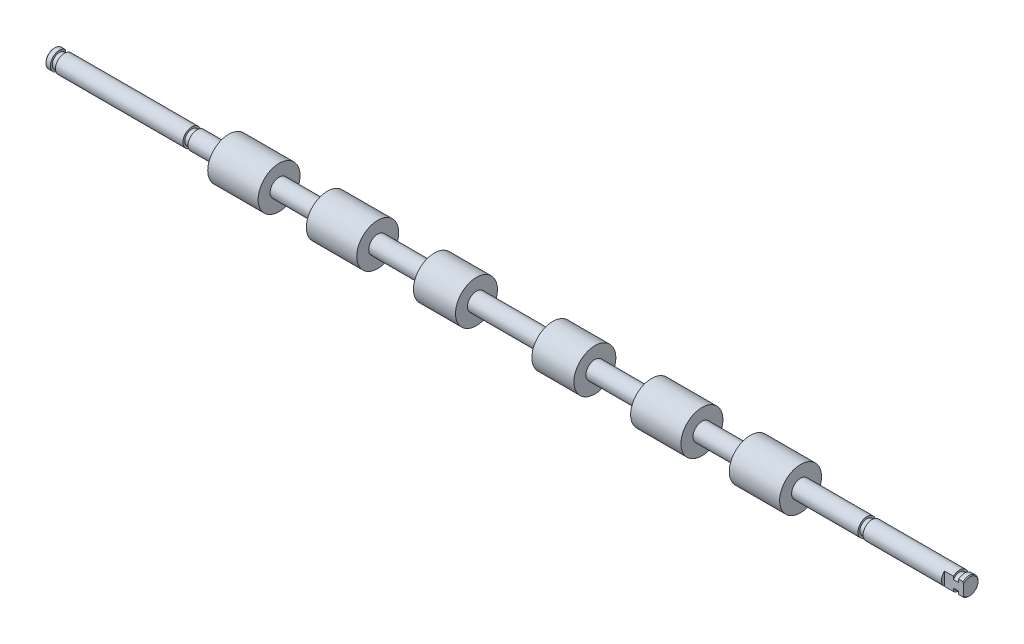
ISO-10303-21;
HEADER;
FILE_DESCRIPTION(('STEP AP214'),'2;1');
FILE_NAME('part.step','',(''),(''),'','','');
FILE_SCHEMA(('AUTOMOTIVE_DESIGN { 1 0 10303 214 1 1 1 1 }'));
ENDSEC;
DATA;
#1=APPLICATION_CONTEXT('core data for automotive mechanical design processes');
#2=APPLICATION_PROTOCOL_DEFINITION('international standard','automotive_design',2000,#1);
#3=PRODUCT_CONTEXT('',#1,'mechanical');
#4=PRODUCT('Part','Part','',(#3));
#5=PRODUCT_RELATED_PRODUCT_CATEGORY('part','',(#4));
#6=PRODUCT_DEFINITION_FORMATION('','',#4);
#7=PRODUCT_DEFINITION_CONTEXT('part definition',#1,'design');
#8=PRODUCT_DEFINITION('design','',#6,#7);
#9=PRODUCT_DEFINITION_SHAPE('','',#8);
#10=(LENGTH_UNIT() NAMED_UNIT(*) SI_UNIT(.MILLI.,.METRE.));
#11=(NAMED_UNIT(*) PLANE_ANGLE_UNIT() SI_UNIT($,.RADIAN.));
#12=(NAMED_UNIT(*) SI_UNIT($,.STERADIAN.) SOLID_ANGLE_UNIT());
#13=UNCERTAINTY_MEASURE_WITH_UNIT(LENGTH_MEASURE(1.E-05),#10,'distance_accuracy_value','');
#14=(GEOMETRIC_REPRESENTATION_CONTEXT(3) GLOBAL_UNCERTAINTY_ASSIGNED_CONTEXT((#13)) GLOBAL_UNIT_ASSIGNED_CONTEXT((#10,
#11,#12)) REPRESENTATION_CONTEXT('',''));
#15=CARTESIAN_POINT('',(0.,0.,0.));
#16=DIRECTION('',(0.,0.,1.));
#17=DIRECTION('',(1.,0.,0.));
#18=AXIS2_PLACEMENT_3D('',#15,#16,#17);
#19=CARTESIAN_POINT('',(0.,0.,0.));
#20=DIRECTION('',(1.,0.,0.));
#21=DIRECTION('',(0.,0.,-1.));
#22=AXIS2_PLACEMENT_3D('',#19,#20,#21);
#23=PLANE('',#22);
#24=DIRECTION('',(0.,1.,0.));
#25=VECTOR('',#24,1.);
#26=CARTESIAN_POINT('',(0.,-6.95,-2.005));
#27=LINE('',#26,#25);
#28=CARTESIAN_POINT('',(0.,-1.84542677990765,-2.005));
#29=VERTEX_POINT('',#28);
#30=CARTESIAN_POINT('',(0.,1.84542677990765,-2.005));
#31=VERTEX_POINT('',#30);
#32=EDGE_CURVE('E151',#29,#31,#27,.T.);
#33=ORIENTED_EDGE('',*,*,#32,.F.);
#34=CARTESIAN_POINT('',(0.,0.,0.));
#35=DIRECTION('',(1.,0.,0.));
#36=DIRECTION('',(0.,0.,-1.));
#37=AXIS2_PLACEMENT_3D('',#34,#35,#36);
#38=CIRCLE('',#37,2.72500000000006);
#39=EDGE_CURVE('E308',#29,#31,#38,.F.);
#40=ORIENTED_EDGE('',*,*,#39,.T.);
#41=EDGE_LOOP('',(#33,#40));
#42=FACE_BOUND('',#41,.T.);
#43=ADVANCED_FACE('F37',(#42),#23,.F.);
#44=CARTESIAN_POINT('',(0.,0.,0.));
#45=DIRECTION('',(-1.,0.,0.));
#46=DIRECTION('',(0.,0.,1.));
#47=AXIS2_PLACEMENT_3D('',#44,#45,#46);
#48=CYLINDRICAL_SURFACE('',#47,2.975);
#49=DIRECTION('',(-1.,0.,0.));
#50=VECTOR('',#49,1.);
#51=CARTESIAN_POINT('',(0.,2.19786259807114,-2.005));
#52=LINE('',#51,#50);
#53=CARTESIAN_POINT('',(1.7,2.19786259807114,-2.005));
#54=VERTEX_POINT('',#53);
#55=CARTESIAN_POINT('',(0.249999999999922,2.19786259807114,-2.005));
#56=VERTEX_POINT('',#55);
#57=EDGE_CURVE('E178',#54,#56,#52,.T.);
#58=ORIENTED_EDGE('',*,*,#57,.T.);
#59=CARTESIAN_POINT('',(0.249999999999922,0.,0.));
#60=DIRECTION('',(1.,0.,0.));
#61=DIRECTION('',(0.,0.,-1.));
#62=AXIS2_PLACEMENT_3D('',#59,#60,#61);
#63=CIRCLE('',#62,2.975);
#64=CARTESIAN_POINT('',(0.249999999999922,-2.19786259807114,-2.005));
#65=VERTEX_POINT('',#64);
#66=EDGE_CURVE('E359',#56,#65,#63,.T.);
#67=ORIENTED_EDGE('',*,*,#66,.T.);
#68=DIRECTION('',(-1.,0.,0.));
#69=VECTOR('',#68,1.);
#70=CARTESIAN_POINT('',(0.,-2.19786259807114,-2.005));
#71=LINE('',#70,#69);
#72=CARTESIAN_POINT('',(1.7,-2.19786259807114,-2.005));
#73=VERTEX_POINT('',#72);
#74=EDGE_CURVE('E172',#65,#73,#71,.F.);
#75=ORIENTED_EDGE('',*,*,#74,.T.);
#76=CARTESIAN_POINT('',(1.7,0.,0.));
#77=DIRECTION('',(-1.,0.,0.));
#78=DIRECTION('',(0.,0.,1.));
#79=AXIS2_PLACEMENT_3D('',#76,#77,#78);
#80=CIRCLE('',#79,2.975);
#81=EDGE_CURVE('E296',#73,#54,#80,.T.);
#82=ORIENTED_EDGE('',*,*,#81,.T.);
#83=EDGE_LOOP('',(#58,#67,#75,#82));
#84=FACE_BOUND('',#83,.T.);
#85=ADVANCED_FACE('F370',(#84),#48,.T.);
#86=CARTESIAN_POINT('',(1.7,2.975,0.));
#87=DIRECTION('',(-1.,0.,0.));
#88=DIRECTION('',(0.,0.,1.));
#89=AXIS2_PLACEMENT_3D('',#86,#87,#88);
#90=PLANE('',#89);
#91=ORIENTED_EDGE('',*,*,#81,.F.);
#92=DIRECTION('',(0.,1.,0.));
#93=VECTOR('',#92,1.);
#94=CARTESIAN_POINT('',(1.7,2.975,-2.005));
#95=LINE('',#94,#93);
#96=CARTESIAN_POINT('',(1.7,-1.225754869458,-2.005));
#97=VERTEX_POINT('',#96);
#98=EDGE_CURVE('E169',#73,#97,#95,.T.);
#99=ORIENTED_EDGE('',*,*,#98,.T.);
#100=CARTESIAN_POINT('',(1.7,0.,0.));
#101=DIRECTION('',(-1.,0.,0.));
#102=DIRECTION('',(0.,0.,1.));
#103=AXIS2_PLACEMENT_3D('',#100,#101,#102);
#104=CIRCLE('',#103,2.35);
#105=CARTESIAN_POINT('',(1.7,1.225754869458,-2.005));
#106=VERTEX_POINT('',#105);
#107=EDGE_CURVE('E293',#97,#106,#104,.T.);
#108=ORIENTED_EDGE('',*,*,#107,.T.);
#109=EDGE_CURVE('E173',#106,#54,#95,.T.);
#110=ORIENTED_EDGE('',*,*,#109,.T.);
#111=EDGE_LOOP('',(#91,#99,#108,#110));
#112=FACE_BOUND('',#111,.T.);
#113=ADVANCED_FACE('F416',(#112),#90,.F.);
#114=CARTESIAN_POINT('',(0.,0.,0.));
#115=DIRECTION('',(-1.,0.,0.));
#116=DIRECTION('',(0.,0.,1.));
#117=AXIS2_PLACEMENT_3D('',#114,#115,#116);
#118=CYLINDRICAL_SURFACE('',#117,2.35);
#119=CARTESIAN_POINT('',(3.4,0.,0.));
#120=DIRECTION('',(-1.,0.,0.));
#121=DIRECTION('',(0.,0.,1.));
#122=AXIS2_PLACEMENT_3D('',#119,#120,#121);
#123=CIRCLE('',#122,2.35);
#124=CARTESIAN_POINT('',(3.4,-1.225754869458,-2.005));
#125=VERTEX_POINT('',#124);
#126=CARTESIAN_POINT('',(3.4,1.225754869458,-2.005));
#127=VERTEX_POINT('',#126);
#128=EDGE_CURVE('E290',#125,#127,#123,.T.);
#129=ORIENTED_EDGE('',*,*,#128,.T.);
#130=DIRECTION('',(-1.,0.,0.));
#131=VECTOR('',#130,1.);
#132=CARTESIAN_POINT('',(0.,1.225754869458,-2.005));
#133=LINE('',#132,#131);
#134=EDGE_CURVE('E175',#127,#106,#133,.T.);
#135=ORIENTED_EDGE('',*,*,#134,.T.);
#136=ORIENTED_EDGE('',*,*,#107,.F.);
#137=DIRECTION('',(-1.,0.,0.));
#138=VECTOR('',#137,1.);
#139=CARTESIAN_POINT('',(0.,-1.225754869458,-2.005));
#140=LINE('',#139,#138);
#141=EDGE_CURVE('E160',#97,#125,#140,.F.);
#142=ORIENTED_EDGE('',*,*,#141,.T.);
#143=EDGE_LOOP('',(#129,#135,#136,#142));
#144=FACE_BOUND('',#143,.T.);
#145=ADVANCED_FACE('F421',(#144),#118,.T.);
#146=CARTESIAN_POINT('',(3.4,2.35,0.));
#147=DIRECTION('',(1.,0.,0.));
#148=DIRECTION('',(0.,0.,-1.));
#149=AXIS2_PLACEMENT_3D('',#146,#147,#148);
#150=PLANE('',#149);
#151=CARTESIAN_POINT('',(3.4,0.,0.));
#152=DIRECTION('',(-1.,0.,0.));
#153=DIRECTION('',(0.,0.,1.));
#154=AXIS2_PLACEMENT_3D('',#151,#152,#153);
#155=CIRCLE('',#154,2.975);
#156=CARTESIAN_POINT('',(3.4,-2.19786259807114,-2.005));
#157=VERTEX_POINT('',#156);
#158=CARTESIAN_POINT('',(3.4,2.19786259807114,-2.005));
#159=VERTEX_POINT('',#158);
#160=EDGE_CURVE('E287',#157,#159,#155,.T.);
#161=ORIENTED_EDGE('',*,*,#160,.T.);
#162=DIRECTION('',(0.,-1.,0.));
#163=VECTOR('',#162,1.);
#164=CARTESIAN_POINT('',(3.4,2.35,-2.005));
#165=LINE('',#164,#163);
#166=EDGE_CURVE('E162',#159,#127,#165,.T.);
#167=ORIENTED_EDGE('',*,*,#166,.T.);
#168=ORIENTED_EDGE('',*,*,#128,.F.);
#169=EDGE_CURVE('E157',#125,#157,#165,.T.);
#170=ORIENTED_EDGE('',*,*,#169,.T.);
#171=EDGE_LOOP('',(#161,#167,#168,#170));
#172=FACE_BOUND('',#171,.T.);
#173=ADVANCED_FACE('F425',(#172),#150,.F.);
#174=CARTESIAN_POINT('',(0.,0.,0.));
#175=DIRECTION('',(-1.,0.,0.));
#176=DIRECTION('',(0.,0.,1.));
#177=AXIS2_PLACEMENT_3D('',#174,#175,#176);
#178=CYLINDRICAL_SURFACE('',#177,2.975);
#179=CARTESIAN_POINT('',(16.3999999999998,0.,0.));
#180=DIRECTION('',(1.,0.,0.));
#181=DIRECTION('',(0.,0.,-1.));
#182=AXIS2_PLACEMENT_3D('',#179,#180,#181);
#183=CIRCLE('',#182,2.975);
#184=CARTESIAN_POINT('',(16.3999999999998,-2.19786259807114,-2.005));
#185=VERTEX_POINT('',#184);
#186=CARTESIAN_POINT('',(16.3999999999998,2.19786259807114,-2.005));
#187=VERTEX_POINT('',#186);
#188=EDGE_CURVE('E302',#185,#187,#183,.T.);
#189=ORIENTED_EDGE('',*,*,#188,.T.);
#190=DIRECTION('',(-1.,0.,0.));
#191=VECTOR('',#190,1.);
#192=CARTESIAN_POINT('',(0.,2.19786259807114,-2.005));
#193=LINE('',#192,#191);
#194=EDGE_CURVE('E305',#187,#159,#193,.T.);
#195=ORIENTED_EDGE('',*,*,#194,.T.);
#196=ORIENTED_EDGE('',*,*,#160,.F.);
#197=DIRECTION('',(-1.,0.,0.));
#198=VECTOR('',#197,1.);
#199=CARTESIAN_POINT('',(0.,-2.19786259807114,-2.005));
#200=LINE('',#199,#198);
#201=EDGE_CURVE('E144',#157,#185,#200,.F.);
#202=ORIENTED_EDGE('',*,*,#201,.T.);
#203=EDGE_LOOP('',(#189,#195,#196,#202));
#204=FACE_BOUND('',#203,.T.);
#205=CARTESIAN_POINT('',(45.65,0.,0.));
#206=DIRECTION('',(-1.,0.,0.));
#207=DIRECTION('',(0.,0.,1.));
#208=AXIS2_PLACEMENT_3D('',#205,#206,#207);
#209=CIRCLE('',#208,2.975);
#210=CARTESIAN_POINT('',(45.65,0.,2.975));
#211=VERTEX_POINT('',#210);
#212=EDGE_CURVE('E284',#211,#211,#209,.T.);
#213=ORIENTED_EDGE('',*,*,#212,.T.);
#214=EDGE_LOOP('',(#213));
#215=FACE_BOUND('',#214,.T.);
#216=ADVANCED_FACE('F429',(#204,#215),#178,.T.);
#217=CARTESIAN_POINT('',(45.65,2.975,0.));
#218=DIRECTION('',(-1.,0.,0.));
#219=DIRECTION('',(0.,0.,1.));
#220=AXIS2_PLACEMENT_3D('',#217,#218,#219);
#221=PLANE('',#220);
#222=ORIENTED_EDGE('',*,*,#212,.F.);
#223=EDGE_LOOP('',(#222));
#224=FACE_BOUND('',#223,.T.);
#225=CARTESIAN_POINT('',(45.65,0.,0.));
#226=DIRECTION('',(-1.,0.,0.));
#227=DIRECTION('',(0.,0.,1.));
#228=AXIS2_PLACEMENT_3D('',#225,#226,#227);
#229=CIRCLE('',#228,2.35);
#230=CARTESIAN_POINT('',(45.65,0.,2.35));
#231=VERTEX_POINT('',#230);
#232=EDGE_CURVE('E281',#231,#231,#229,.T.);
#233=ORIENTED_EDGE('',*,*,#232,.T.);
#234=EDGE_LOOP('',(#233));
#235=FACE_BOUND('',#234,.T.);
#236=ADVANCED_FACE('F433',(#224,#235),#221,.F.);
#237=CARTESIAN_POINT('',(0.,0.,0.));
#238=DIRECTION('',(-1.,0.,0.));
#239=DIRECTION('',(0.,0.,1.));
#240=AXIS2_PLACEMENT_3D('',#237,#238,#239);
#241=CYLINDRICAL_SURFACE('',#240,2.35);
#242=ORIENTED_EDGE('',*,*,#232,.F.);
#243=EDGE_LOOP('',(#242));
#244=FACE_BOUND('',#243,.T.);
#245=CARTESIAN_POINT('',(47.35,0.,0.));
#246=DIRECTION('',(-1.,0.,0.));
#247=DIRECTION('',(0.,0.,1.));
#248=AXIS2_PLACEMENT_3D('',#245,#246,#247);
#249=CIRCLE('',#248,2.35);
#250=CARTESIAN_POINT('',(47.35,0.,2.35));
#251=VERTEX_POINT('',#250);
#252=EDGE_CURVE('E278',#251,#251,#249,.T.);
#253=ORIENTED_EDGE('',*,*,#252,.T.);
#254=EDGE_LOOP('',(#253));
#255=FACE_BOUND('',#254,.T.);
#256=ADVANCED_FACE('F437',(#244,#255),#241,.T.);
#257=CARTESIAN_POINT('',(47.35,2.35,0.));
#258=DIRECTION('',(1.,0.,0.));
#259=DIRECTION('',(0.,0.,-1.));
#260=AXIS2_PLACEMENT_3D('',#257,#258,#259);
#261=PLANE('',#260);
#262=ORIENTED_EDGE('',*,*,#252,.F.);
#263=EDGE_LOOP('',(#262));
#264=FACE_BOUND('',#263,.T.);
#265=CARTESIAN_POINT('',(47.35,0.,0.));
#266=DIRECTION('',(-1.,0.,0.));
#267=DIRECTION('',(0.,0.,1.));
#268=AXIS2_PLACEMENT_3D('',#265,#266,#267);
#269=CIRCLE('',#268,2.975);
#270=CARTESIAN_POINT('',(47.35,0.,2.975));
#271=VERTEX_POINT('',#270);
#272=EDGE_CURVE('E275',#271,#271,#269,.T.);
#273=ORIENTED_EDGE('',*,*,#272,.T.);
#274=EDGE_LOOP('',(#273));
#275=FACE_BOUND('',#274,.T.);
#276=ADVANCED_FACE('F441',(#264,#275),#261,.F.);
#277=CARTESIAN_POINT('',(0.,0.,0.));
#278=DIRECTION('',(-1.,0.,0.));
#279=DIRECTION('',(0.,0.,1.));
#280=AXIS2_PLACEMENT_3D('',#277,#278,#279);
#281=CYLINDRICAL_SURFACE('',#280,2.975);
#282=ORIENTED_EDGE('',*,*,#272,.F.);
#283=EDGE_LOOP('',(#282));
#284=FACE_BOUND('',#283,.T.);
#285=CARTESIAN_POINT('',(57.85,0.,0.));
#286=DIRECTION('',(-1.,0.,0.));
#287=DIRECTION('',(0.,0.,1.));
#288=AXIS2_PLACEMENT_3D('',#285,#286,#287);
#289=CIRCLE('',#288,2.975);
#290=CARTESIAN_POINT('',(57.85,0.,2.975));
#291=VERTEX_POINT('',#290);
#292=EDGE_CURVE('E272',#291,#291,#289,.T.);
#293=ORIENTED_EDGE('',*,*,#292,.T.);
#294=EDGE_LOOP('',(#293));
#295=FACE_BOUND('',#294,.T.);
#296=ADVANCED_FACE('F445',(#284,#295),#281,.T.);
#297=CARTESIAN_POINT('',(57.85,2.975,0.));
#298=DIRECTION('',(1.,0.,0.));
#299=DIRECTION('',(0.,0.,-1.));
#300=AXIS2_PLACEMENT_3D('',#297,#298,#299);
#301=PLANE('',#300);
#302=ORIENTED_EDGE('',*,*,#292,.F.);
#303=EDGE_LOOP('',(#302));
#304=FACE_BOUND('',#303,.T.);
#305=CARTESIAN_POINT('',(57.85,0.,0.));
#306=DIRECTION('',(-1.,0.,0.));
#307=DIRECTION('',(0.,0.,1.));
#308=AXIS2_PLACEMENT_3D('',#305,#306,#307);
#309=CIRCLE('',#308,6.95);
#310=CARTESIAN_POINT('',(57.85,0.,6.95));
#311=VERTEX_POINT('',#310);
#312=EDGE_CURVE('E269',#311,#311,#309,.T.);
#313=ORIENTED_EDGE('',*,*,#312,.T.);
#314=EDGE_LOOP('',(#313));
#315=FACE_BOUND('',#314,.T.);
#316=ADVANCED_FACE('F449',(#304,#315),#301,.F.);
#317=CARTESIAN_POINT('',(0.,0.,0.));
#318=DIRECTION('',(-1.,0.,0.));
#319=DIRECTION('',(0.,0.,1.));
#320=AXIS2_PLACEMENT_3D('',#317,#318,#319);
#321=CYLINDRICAL_SURFACE('',#320,6.95);
#322=ORIENTED_EDGE('',*,*,#312,.F.);
#323=EDGE_LOOP('',(#322));
#324=FACE_BOUND('',#323,.T.);
#325=CARTESIAN_POINT('',(74.55,0.,0.));
#326=DIRECTION('',(-1.,0.,0.));
#327=DIRECTION('',(0.,0.,1.));
#328=AXIS2_PLACEMENT_3D('',#325,#326,#327);
#329=CIRCLE('',#328,6.95);
#330=CARTESIAN_POINT('',(74.55,0.,6.95));
#331=VERTEX_POINT('',#330);
#332=EDGE_CURVE('E266',#331,#331,#329,.T.);
#333=ORIENTED_EDGE('',*,*,#332,.T.);
#334=EDGE_LOOP('',(#333));
#335=FACE_BOUND('',#334,.T.);
#336=ADVANCED_FACE('F453',(#324,#335),#321,.T.);
#337=CARTESIAN_POINT('',(74.55,6.95,0.));
#338=DIRECTION('',(-1.,0.,0.));
#339=DIRECTION('',(0.,0.,1.));
#340=AXIS2_PLACEMENT_3D('',#337,#338,#339);
#341=PLANE('',#340);
#342=ORIENTED_EDGE('',*,*,#332,.F.);
#343=EDGE_LOOP('',(#342));
#344=FACE_BOUND('',#343,.T.);
#345=CARTESIAN_POINT('',(74.55,0.,0.));
#346=DIRECTION('',(-1.,0.,0.));
#347=DIRECTION('',(0.,0.,1.));
#348=AXIS2_PLACEMENT_3D('',#345,#346,#347);
#349=CIRCLE('',#348,2.975);
#350=CARTESIAN_POINT('',(74.55,0.,2.975));
#351=VERTEX_POINT('',#350);
#352=EDGE_CURVE('E263',#351,#351,#349,.T.);
#353=ORIENTED_EDGE('',*,*,#352,.T.);
#354=EDGE_LOOP('',(#353));
#355=FACE_BOUND('',#354,.T.);
#356=ADVANCED_FACE('F457',(#344,#355),#341,.F.);
#357=CARTESIAN_POINT('',(0.,0.,0.));
#358=DIRECTION('',(-1.,0.,0.));
#359=DIRECTION('',(0.,0.,1.));
#360=AXIS2_PLACEMENT_3D('',#357,#358,#359);
#361=CYLINDRICAL_SURFACE('',#360,2.975);
#362=ORIENTED_EDGE('',*,*,#352,.F.);
#363=EDGE_LOOP('',(#362));
#364=FACE_BOUND('',#363,.T.);
#365=CARTESIAN_POINT('',(90.55,0.,0.));
#366=DIRECTION('',(-1.,0.,0.));
#367=DIRECTION('',(0.,0.,1.));
#368=AXIS2_PLACEMENT_3D('',#365,#366,#367);
#369=CIRCLE('',#368,2.975);
#370=CARTESIAN_POINT('',(90.55,0.,2.975));
#371=VERTEX_POINT('',#370);
#372=EDGE_CURVE('E260',#371,#371,#369,.T.);
#373=ORIENTED_EDGE('',*,*,#372,.T.);
#374=EDGE_LOOP('',(#373));
#375=FACE_BOUND('',#374,.T.);
#376=ADVANCED_FACE('F461',(#364,#375),#361,.T.);
#377=CARTESIAN_POINT('',(90.55,2.975,0.));
#378=DIRECTION('',(1.,0.,0.));
#379=DIRECTION('',(0.,0.,-1.));
#380=AXIS2_PLACEMENT_3D('',#377,#378,#379);
#381=PLANE('',#380);
#382=ORIENTED_EDGE('',*,*,#372,.F.);
#383=EDGE_LOOP('',(#382));
#384=FACE_BOUND('',#383,.T.);
#385=CARTESIAN_POINT('',(90.55,0.,0.));
#386=DIRECTION('',(-1.,0.,0.));
#387=DIRECTION('',(0.,0.,1.));
#388=AXIS2_PLACEMENT_3D('',#385,#386,#387);
#389=CIRCLE('',#388,6.95);
#390=CARTESIAN_POINT('',(90.55,0.,6.95));
#391=VERTEX_POINT('',#390);
#392=EDGE_CURVE('E257',#391,#391,#389,.T.);
#393=ORIENTED_EDGE('',*,*,#392,.T.);
#394=EDGE_LOOP('',(#393));
#395=FACE_BOUND('',#394,.T.);
#396=ADVANCED_FACE('F465',(#384,#395),#381,.F.);
#397=CARTESIAN_POINT('',(0.,0.,0.));
#398=DIRECTION('',(-1.,0.,0.));
#399=DIRECTION('',(0.,0.,1.));
#400=AXIS2_PLACEMENT_3D('',#397,#398,#399);
#401=CYLINDRICAL_SURFACE('',#400,6.95);
#402=ORIENTED_EDGE('',*,*,#392,.F.);
#403=EDGE_LOOP('',(#402));
#404=FACE_BOUND('',#403,.T.);
#405=CARTESIAN_POINT('',(107.25,0.,0.));
#406=DIRECTION('',(-1.,0.,0.));
#407=DIRECTION('',(0.,0.,1.));
#408=AXIS2_PLACEMENT_3D('',#405,#406,#407);
#409=CIRCLE('',#408,6.95);
#410=CARTESIAN_POINT('',(107.25,0.,6.95));
#411=VERTEX_POINT('',#410);
#412=EDGE_CURVE('E254',#411,#411,#409,.T.);
#413=ORIENTED_EDGE('',*,*,#412,.T.);
#414=EDGE_LOOP('',(#413));
#415=FACE_BOUND('',#414,.T.);
#416=ADVANCED_FACE('F469',(#404,#415),#401,.T.);
#417=CARTESIAN_POINT('',(107.25,6.95,0.));
#418=DIRECTION('',(-1.,0.,0.));
#419=DIRECTION('',(0.,0.,1.));
#420=AXIS2_PLACEMENT_3D('',#417,#418,#419);
#421=PLANE('',#420);
#422=ORIENTED_EDGE('',*,*,#412,.F.);
#423=EDGE_LOOP('',(#422));
#424=FACE_BOUND('',#423,.T.);
#425=CARTESIAN_POINT('',(107.25,0.,0.));
#426=DIRECTION('',(-1.,0.,0.));
#427=DIRECTION('',(0.,0.,1.));
#428=AXIS2_PLACEMENT_3D('',#425,#426,#427);
#429=CIRCLE('',#428,2.975);
#430=CARTESIAN_POINT('',(107.25,0.,2.975));
#431=VERTEX_POINT('',#430);
#432=EDGE_CURVE('E251',#431,#431,#429,.T.);
#433=ORIENTED_EDGE('',*,*,#432,.T.);
#434=EDGE_LOOP('',(#433));
#435=FACE_BOUND('',#434,.T.);
#436=ADVANCED_FACE('F473',(#424,#435),#421,.F.);
#437=CARTESIAN_POINT('',(0.,0.,0.));
#438=DIRECTION('',(-1.,0.,0.));
#439=DIRECTION('',(0.,0.,1.));
#440=AXIS2_PLACEMENT_3D('',#437,#438,#439);
#441=CYLINDRICAL_SURFACE('',#440,2.975);
#442=ORIENTED_EDGE('',*,*,#432,.F.);
#443=EDGE_LOOP('',(#442));
#444=FACE_BOUND('',#443,.T.);
#445=CARTESIAN_POINT('',(126.05,0.,0.));
#446=DIRECTION('',(-1.,0.,0.));
#447=DIRECTION('',(0.,0.,1.));
#448=AXIS2_PLACEMENT_3D('',#445,#446,#447);
#449=CIRCLE('',#448,2.975);
#450=CARTESIAN_POINT('',(126.05,0.,2.975));
#451=VERTEX_POINT('',#450);
#452=EDGE_CURVE('E248',#451,#451,#449,.T.);
#453=ORIENTED_EDGE('',*,*,#452,.T.);
#454=EDGE_LOOP('',(#453));
#455=FACE_BOUND('',#454,.T.);
#456=ADVANCED_FACE('F477',(#444,#455),#441,.T.);
#457=CARTESIAN_POINT('',(126.05,2.975,0.));
#458=DIRECTION('',(1.,0.,0.));
#459=DIRECTION('',(0.,0.,-1.));
#460=AXIS2_PLACEMENT_3D('',#457,#458,#459);
#461=PLANE('',#460);
#462=ORIENTED_EDGE('',*,*,#452,.F.);
#463=EDGE_LOOP('',(#462));
#464=FACE_BOUND('',#463,.T.);
#465=CARTESIAN_POINT('',(126.05,0.,0.));
#466=DIRECTION('',(-1.,0.,0.));
#467=DIRECTION('',(0.,0.,1.));
#468=AXIS2_PLACEMENT_3D('',#465,#466,#467);
#469=CIRCLE('',#468,6.95);
#470=CARTESIAN_POINT('',(126.05,0.,6.95));
#471=VERTEX_POINT('',#470);
#472=EDGE_CURVE('E245',#471,#471,#469,.T.);
#473=ORIENTED_EDGE('',*,*,#472,.T.);
#474=EDGE_LOOP('',(#473));
#475=FACE_BOUND('',#474,.T.);
#476=ADVANCED_FACE('F481',(#464,#475),#461,.F.);
#477=CARTESIAN_POINT('',(0.,0.,0.));
#478=DIRECTION('',(-1.,0.,0.));
#479=DIRECTION('',(0.,0.,1.));
#480=AXIS2_PLACEMENT_3D('',#477,#478,#479);
#481=CYLINDRICAL_SURFACE('',#480,6.95);
#482=ORIENTED_EDGE('',*,*,#472,.F.);
#483=EDGE_LOOP('',(#482));
#484=FACE_BOUND('',#483,.T.);
#485=CARTESIAN_POINT('',(140.,0.,0.));
#486=DIRECTION('',(-1.,0.,0.));
#487=DIRECTION('',(0.,0.,1.));
#488=AXIS2_PLACEMENT_3D('',#485,#486,#487);
#489=CIRCLE('',#488,6.95);
#490=CARTESIAN_POINT('',(140.,0.,6.95));
#491=VERTEX_POINT('',#490);
#492=EDGE_CURVE('E242',#491,#491,#489,.T.);
#493=ORIENTED_EDGE('',*,*,#492,.T.);
#494=EDGE_LOOP('',(#493));
#495=FACE_BOUND('',#494,.T.);
#496=ADVANCED_FACE('F485',(#484,#495),#481,.T.);
#497=CARTESIAN_POINT('',(140.,6.95,0.));
#498=DIRECTION('',(-1.,0.,0.));
#499=DIRECTION('',(0.,0.,1.));
#500=AXIS2_PLACEMENT_3D('',#497,#498,#499);
#501=PLANE('',#500);
#502=ORIENTED_EDGE('',*,*,#492,.F.);
#503=EDGE_LOOP('',(#502));
#504=FACE_BOUND('',#503,.T.);
#505=CARTESIAN_POINT('',(140.,0.,0.));
#506=DIRECTION('',(-1.,0.,0.));
#507=DIRECTION('',(0.,0.,1.));
#508=AXIS2_PLACEMENT_3D('',#505,#506,#507);
#509=CIRCLE('',#508,2.975);
#510=CARTESIAN_POINT('',(140.,0.,2.975));
#511=VERTEX_POINT('',#510);
#512=EDGE_CURVE('E239',#511,#511,#509,.T.);
#513=ORIENTED_EDGE('',*,*,#512,.T.);
#514=EDGE_LOOP('',(#513));
#515=FACE_BOUND('',#514,.T.);
#516=ADVANCED_FACE('F489',(#504,#515),#501,.F.);
#517=CARTESIAN_POINT('',(0.,0.,0.));
#518=DIRECTION('',(-1.,0.,0.));
#519=DIRECTION('',(0.,0.,1.));
#520=AXIS2_PLACEMENT_3D('',#517,#518,#519);
#521=CYLINDRICAL_SURFACE('',#520,2.975);
#522=ORIENTED_EDGE('',*,*,#512,.F.);
#523=EDGE_LOOP('',(#522));
#524=FACE_BOUND('',#523,.T.);
#525=CARTESIAN_POINT('',(165.3,0.,0.));
#526=DIRECTION('',(-1.,0.,0.));
#527=DIRECTION('',(0.,0.,1.));
#528=AXIS2_PLACEMENT_3D('',#525,#526,#527);
#529=CIRCLE('',#528,2.975);
#530=CARTESIAN_POINT('',(165.3,0.,2.975));
#531=VERTEX_POINT('',#530);
#532=EDGE_CURVE('E236',#531,#531,#529,.T.);
#533=ORIENTED_EDGE('',*,*,#532,.T.);
#534=EDGE_LOOP('',(#533));
#535=FACE_BOUND('',#534,.T.);
#536=ADVANCED_FACE('F493',(#524,#535),#521,.T.);
#537=CARTESIAN_POINT('',(165.3,6.95,0.));
#538=DIRECTION('',(1.,0.,0.));
#539=DIRECTION('',(0.,0.,-1.));
#540=AXIS2_PLACEMENT_3D('',#537,#538,#539);
#541=PLANE('',#540);
#542=ORIENTED_EDGE('',*,*,#532,.F.);
#543=EDGE_LOOP('',(#542));
#544=FACE_BOUND('',#543,.T.);
#545=CARTESIAN_POINT('',(165.3,0.,0.));
#546=DIRECTION('',(-1.,0.,0.));
#547=DIRECTION('',(0.,0.,1.));
#548=AXIS2_PLACEMENT_3D('',#545,#546,#547);
#549=CIRCLE('',#548,6.95);
#550=CARTESIAN_POINT('',(165.3,0.,6.95));
#551=VERTEX_POINT('',#550);
#552=EDGE_CURVE('E233',#551,#551,#549,.T.);
#553=ORIENTED_EDGE('',*,*,#552,.T.);
#554=EDGE_LOOP('',(#553));
#555=FACE_BOUND('',#554,.T.);
#556=ADVANCED_FACE('F497',(#544,#555),#541,.F.);
#557=CARTESIAN_POINT('',(0.,0.,0.));
#558=DIRECTION('',(-1.,0.,0.));
#559=DIRECTION('',(0.,0.,1.));
#560=AXIS2_PLACEMENT_3D('',#557,#558,#559);
#561=CYLINDRICAL_SURFACE('',#560,6.95);
#562=ORIENTED_EDGE('',*,*,#552,.F.);
#563=EDGE_LOOP('',(#562));
#564=FACE_BOUND('',#563,.T.);
#565=CARTESIAN_POINT('',(179.25,0.,0.));
#566=DIRECTION('',(-1.,0.,0.));
#567=DIRECTION('',(0.,0.,1.));
#568=AXIS2_PLACEMENT_3D('',#565,#566,#567);
#569=CIRCLE('',#568,6.95);
#570=CARTESIAN_POINT('',(179.25,0.,6.95));
#571=VERTEX_POINT('',#570);
#572=EDGE_CURVE('E230',#571,#571,#569,.T.);
#573=ORIENTED_EDGE('',*,*,#572,.T.);
#574=EDGE_LOOP('',(#573));
#575=FACE_BOUND('',#574,.T.);
#576=ADVANCED_FACE('F501',(#564,#575),#561,.T.);
#577=CARTESIAN_POINT('',(179.25,2.975,0.));
#578=DIRECTION('',(-1.,0.,0.));
#579=DIRECTION('',(0.,0.,1.));
#580=AXIS2_PLACEMENT_3D('',#577,#578,#579);
#581=PLANE('',#580);
#582=ORIENTED_EDGE('',*,*,#572,.F.);
#583=EDGE_LOOP('',(#582));
#584=FACE_BOUND('',#583,.T.);
#585=CARTESIAN_POINT('',(179.25,0.,0.));
#586=DIRECTION('',(-1.,0.,0.));
#587=DIRECTION('',(0.,0.,1.));
#588=AXIS2_PLACEMENT_3D('',#585,#586,#587);
#589=CIRCLE('',#588,2.975);
#590=CARTESIAN_POINT('',(179.25,0.,2.975));
#591=VERTEX_POINT('',#590);
#592=EDGE_CURVE('E227',#591,#591,#589,.T.);
#593=ORIENTED_EDGE('',*,*,#592,.T.);
#594=EDGE_LOOP('',(#593));
#595=FACE_BOUND('',#594,.T.);
#596=ADVANCED_FACE('F505',(#584,#595),#581,.F.);
#597=CARTESIAN_POINT('',(0.,0.,0.));
#598=DIRECTION('',(-1.,0.,0.));
#599=DIRECTION('',(0.,0.,1.));
#600=AXIS2_PLACEMENT_3D('',#597,#598,#599);
#601=CYLINDRICAL_SURFACE('',#600,2.975);
#602=ORIENTED_EDGE('',*,*,#592,.F.);
#603=EDGE_LOOP('',(#602));
#604=FACE_BOUND('',#603,.T.);
#605=CARTESIAN_POINT('',(198.05,0.,0.));
#606=DIRECTION('',(-1.,0.,0.));
#607=DIRECTION('',(0.,0.,1.));
#608=AXIS2_PLACEMENT_3D('',#605,#606,#607);
#609=CIRCLE('',#608,2.975);
#610=CARTESIAN_POINT('',(198.05,0.,2.975));
#611=VERTEX_POINT('',#610);
#612=EDGE_CURVE('E224',#611,#611,#609,.T.);
#613=ORIENTED_EDGE('',*,*,#612,.T.);
#614=EDGE_LOOP('',(#613));
#615=FACE_BOUND('',#614,.T.);
#616=ADVANCED_FACE('F509',(#604,#615),#601,.T.);
#617=CARTESIAN_POINT('',(198.05,6.95,0.));
#618=DIRECTION('',(1.,0.,0.));
#619=DIRECTION('',(0.,0.,-1.));
#620=AXIS2_PLACEMENT_3D('',#617,#618,#619);
#621=PLANE('',#620);
#622=ORIENTED_EDGE('',*,*,#612,.F.);
#623=EDGE_LOOP('',(#622));
#624=FACE_BOUND('',#623,.T.);
#625=CARTESIAN_POINT('',(198.05,0.,0.));
#626=DIRECTION('',(-1.,0.,0.));
#627=DIRECTION('',(0.,0.,1.));
#628=AXIS2_PLACEMENT_3D('',#625,#626,#627);
#629=CIRCLE('',#628,6.95);
#630=CARTESIAN_POINT('',(198.05,0.,6.95));
#631=VERTEX_POINT('',#630);
#632=EDGE_CURVE('E221',#631,#631,#629,.T.);
#633=ORIENTED_EDGE('',*,*,#632,.T.);
#634=EDGE_LOOP('',(#633));
#635=FACE_BOUND('',#634,.T.);
#636=ADVANCED_FACE('F513',(#624,#635),#621,.F.);
#637=CARTESIAN_POINT('',(0.,0.,0.));
#638=DIRECTION('',(-1.,0.,0.));
#639=DIRECTION('',(0.,0.,1.));
#640=AXIS2_PLACEMENT_3D('',#637,#638,#639);
#641=CYLINDRICAL_SURFACE('',#640,6.95);
#642=ORIENTED_EDGE('',*,*,#632,.F.);
#643=EDGE_LOOP('',(#642));
#644=FACE_BOUND('',#643,.T.);
#645=CARTESIAN_POINT('',(214.75,0.,0.));
#646=DIRECTION('',(-1.,0.,0.));
#647=DIRECTION('',(0.,0.,1.));
#648=AXIS2_PLACEMENT_3D('',#645,#646,#647);
#649=CIRCLE('',#648,6.95);
#650=CARTESIAN_POINT('',(214.75,0.,6.95));
#651=VERTEX_POINT('',#650);
#652=EDGE_CURVE('E218',#651,#651,#649,.T.);
#653=ORIENTED_EDGE('',*,*,#652,.T.);
#654=EDGE_LOOP('',(#653));
#655=FACE_BOUND('',#654,.T.);
#656=ADVANCED_FACE('F517',(#644,#655),#641,.T.);
#657=CARTESIAN_POINT('',(214.75,2.975,0.));
#658=DIRECTION('',(-1.,0.,0.));
#659=DIRECTION('',(0.,0.,1.));
#660=AXIS2_PLACEMENT_3D('',#657,#658,#659);
#661=PLANE('',#660);
#662=ORIENTED_EDGE('',*,*,#652,.F.);
#663=EDGE_LOOP('',(#662));
#664=FACE_BOUND('',#663,.T.);
#665=CARTESIAN_POINT('',(214.75,0.,0.));
#666=DIRECTION('',(-1.,0.,0.));
#667=DIRECTION('',(0.,0.,1.));
#668=AXIS2_PLACEMENT_3D('',#665,#666,#667);
#669=CIRCLE('',#668,2.975);
#670=CARTESIAN_POINT('',(214.75,0.,2.975));
#671=VERTEX_POINT('',#670);
#672=EDGE_CURVE('E215',#671,#671,#669,.T.);
#673=ORIENTED_EDGE('',*,*,#672,.T.);
#674=EDGE_LOOP('',(#673));
#675=FACE_BOUND('',#674,.T.);
#676=ADVANCED_FACE('F521',(#664,#675),#661,.F.);
#677=CARTESIAN_POINT('',(0.,0.,0.));
#678=DIRECTION('',(-1.,0.,0.));
#679=DIRECTION('',(0.,0.,1.));
#680=AXIS2_PLACEMENT_3D('',#677,#678,#679);
#681=CYLINDRICAL_SURFACE('',#680,2.975);
#682=ORIENTED_EDGE('',*,*,#672,.F.);
#683=EDGE_LOOP('',(#682));
#684=FACE_BOUND('',#683,.T.);
#685=CARTESIAN_POINT('',(230.75,0.,0.));
#686=DIRECTION('',(-1.,0.,0.));
#687=DIRECTION('',(0.,0.,1.));
#688=AXIS2_PLACEMENT_3D('',#685,#686,#687);
#689=CIRCLE('',#688,2.975);
#690=CARTESIAN_POINT('',(230.75,0.,2.975));
#691=VERTEX_POINT('',#690);
#692=EDGE_CURVE('E212',#691,#691,#689,.T.);
#693=ORIENTED_EDGE('',*,*,#692,.T.);
#694=EDGE_LOOP('',(#693));
#695=FACE_BOUND('',#694,.T.);
#696=ADVANCED_FACE('F525',(#684,#695),#681,.T.);
#697=CARTESIAN_POINT('',(230.75,6.95,0.));
#698=DIRECTION('',(1.,0.,0.));
#699=DIRECTION('',(0.,0.,-1.));
#700=AXIS2_PLACEMENT_3D('',#697,#698,#699);
#701=PLANE('',#700);
#702=ORIENTED_EDGE('',*,*,#692,.F.);
#703=EDGE_LOOP('',(#702));
#704=FACE_BOUND('',#703,.T.);
#705=CARTESIAN_POINT('',(230.75,0.,0.));
#706=DIRECTION('',(-1.,0.,0.));
#707=DIRECTION('',(0.,0.,1.));
#708=AXIS2_PLACEMENT_3D('',#705,#706,#707);
#709=CIRCLE('',#708,6.95);
#710=CARTESIAN_POINT('',(230.75,0.,6.95));
#711=VERTEX_POINT('',#710);
#712=EDGE_CURVE('E209',#711,#711,#709,.T.);
#713=ORIENTED_EDGE('',*,*,#712,.T.);
#714=EDGE_LOOP('',(#713));
#715=FACE_BOUND('',#714,.T.);
#716=ADVANCED_FACE('F529',(#704,#715),#701,.F.);
#717=CARTESIAN_POINT('',(0.,0.,0.));
#718=DIRECTION('',(-1.,0.,0.));
#719=DIRECTION('',(0.,0.,1.));
#720=AXIS2_PLACEMENT_3D('',#717,#718,#719);
#721=CYLINDRICAL_SURFACE('',#720,6.95);
#722=ORIENTED_EDGE('',*,*,#712,.F.);
#723=EDGE_LOOP('',(#722));
#724=FACE_BOUND('',#723,.T.);
#725=CARTESIAN_POINT('',(247.45,0.,0.));
#726=DIRECTION('',(-1.,0.,0.));
#727=DIRECTION('',(0.,0.,1.));
#728=AXIS2_PLACEMENT_3D('',#725,#726,#727);
#729=CIRCLE('',#728,6.95);
#730=CARTESIAN_POINT('',(247.45,0.,6.95));
#731=VERTEX_POINT('',#730);
#732=EDGE_CURVE('E206',#731,#731,#729,.T.);
#733=ORIENTED_EDGE('',*,*,#732,.T.);
#734=EDGE_LOOP('',(#733));
#735=FACE_BOUND('',#734,.T.);
#736=ADVANCED_FACE('F533',(#724,#735),#721,.T.);
#737=CARTESIAN_POINT('',(247.45,2.975,0.));
#738=DIRECTION('',(-1.,0.,0.));
#739=DIRECTION('',(0.,0.,1.));
#740=AXIS2_PLACEMENT_3D('',#737,#738,#739);
#741=PLANE('',#740);
#742=ORIENTED_EDGE('',*,*,#732,.F.);
#743=EDGE_LOOP('',(#742));
#744=FACE_BOUND('',#743,.T.);
#745=CARTESIAN_POINT('',(247.45,0.,0.));
#746=DIRECTION('',(-1.,0.,0.));
#747=DIRECTION('',(0.,0.,1.));
#748=AXIS2_PLACEMENT_3D('',#745,#746,#747);
#749=CIRCLE('',#748,2.975);
#750=CARTESIAN_POINT('',(247.45,0.,2.975));
#751=VERTEX_POINT('',#750);
#752=EDGE_CURVE('E203',#751,#751,#749,.T.);
#753=ORIENTED_EDGE('',*,*,#752,.T.);
#754=EDGE_LOOP('',(#753));
#755=FACE_BOUND('',#754,.T.);
#756=ADVANCED_FACE('F537',(#744,#755),#741,.F.);
#757=CARTESIAN_POINT('',(0.,0.,0.));
#758=DIRECTION('',(-1.,0.,0.));
#759=DIRECTION('',(0.,0.,1.));
#760=AXIS2_PLACEMENT_3D('',#757,#758,#759);
#761=CYLINDRICAL_SURFACE('',#760,2.975);
#762=ORIENTED_EDGE('',*,*,#752,.F.);
#763=EDGE_LOOP('',(#762));
#764=FACE_BOUND('',#763,.T.);
#765=CARTESIAN_POINT('',(269.45,0.,0.));
#766=DIRECTION('',(-1.,0.,0.));
#767=DIRECTION('',(0.,0.,1.));
#768=AXIS2_PLACEMENT_3D('',#765,#766,#767);
#769=CIRCLE('',#768,2.975);
#770=CARTESIAN_POINT('',(269.45,0.,2.975));
#771=VERTEX_POINT('',#770);
#772=EDGE_CURVE('E200',#771,#771,#769,.T.);
#773=ORIENTED_EDGE('',*,*,#772,.T.);
#774=EDGE_LOOP('',(#773));
#775=FACE_BOUND('',#774,.T.);
#776=ADVANCED_FACE('F541',(#764,#775),#761,.T.);
#777=CARTESIAN_POINT('',(269.45,2.975,0.));
#778=DIRECTION('',(-1.,0.,0.));
#779=DIRECTION('',(0.,0.,1.));
#780=AXIS2_PLACEMENT_3D('',#777,#778,#779);
#781=PLANE('',#780);
#782=ORIENTED_EDGE('',*,*,#772,.F.);
#783=EDGE_LOOP('',(#782));
#784=FACE_BOUND('',#783,.T.);
#785=CARTESIAN_POINT('',(269.45,0.,0.));
#786=DIRECTION('',(-1.,0.,0.));
#787=DIRECTION('',(0.,0.,1.));
#788=AXIS2_PLACEMENT_3D('',#785,#786,#787);
#789=CIRCLE('',#788,2.35);
#790=CARTESIAN_POINT('',(269.45,0.,2.35));
#791=VERTEX_POINT('',#790);
#792=EDGE_CURVE('E197',#791,#791,#789,.T.);
#793=ORIENTED_EDGE('',*,*,#792,.T.);
#794=EDGE_LOOP('',(#793));
#795=FACE_BOUND('',#794,.T.);
#796=ADVANCED_FACE('F545',(#784,#795),#781,.F.);
#797=CARTESIAN_POINT('',(0.,0.,0.));
#798=DIRECTION('',(-1.,0.,0.));
#799=DIRECTION('',(0.,0.,1.));
#800=AXIS2_PLACEMENT_3D('',#797,#798,#799);
#801=CYLINDRICAL_SURFACE('',#800,2.35);
#802=ORIENTED_EDGE('',*,*,#792,.F.);
#803=EDGE_LOOP('',(#802));
#804=FACE_BOUND('',#803,.T.);
#805=CARTESIAN_POINT('',(271.15,0.,0.));
#806=DIRECTION('',(-1.,0.,0.));
#807=DIRECTION('',(0.,0.,1.));
#808=AXIS2_PLACEMENT_3D('',#805,#806,#807);
#809=CIRCLE('',#808,2.35);
#810=CARTESIAN_POINT('',(271.15,0.,2.35));
#811=VERTEX_POINT('',#810);
#812=EDGE_CURVE('E194',#811,#811,#809,.T.);
#813=ORIENTED_EDGE('',*,*,#812,.T.);
#814=EDGE_LOOP('',(#813));
#815=FACE_BOUND('',#814,.T.);
#816=ADVANCED_FACE('F549',(#804,#815),#801,.T.);
#817=CARTESIAN_POINT('',(271.15,2.35,0.));
#818=DIRECTION('',(1.,0.,0.));
#819=DIRECTION('',(0.,0.,-1.));
#820=AXIS2_PLACEMENT_3D('',#817,#818,#819);
#821=PLANE('',#820);
#822=ORIENTED_EDGE('',*,*,#812,.F.);
#823=EDGE_LOOP('',(#822));
#824=FACE_BOUND('',#823,.T.);
#825=CARTESIAN_POINT('',(271.15,0.,0.));
#826=DIRECTION('',(-1.,0.,0.));
#827=DIRECTION('',(0.,0.,1.));
#828=AXIS2_PLACEMENT_3D('',#825,#826,#827);
#829=CIRCLE('',#828,2.975);
#830=CARTESIAN_POINT('',(271.15,0.,2.975));
#831=VERTEX_POINT('',#830);
#832=EDGE_CURVE('E191',#831,#831,#829,.T.);
#833=ORIENTED_EDGE('',*,*,#832,.T.);
#834=EDGE_LOOP('',(#833));
#835=FACE_BOUND('',#834,.T.);
#836=ADVANCED_FACE('F553',(#824,#835),#821,.F.);
#837=CARTESIAN_POINT('',(0.,0.,0.));
#838=DIRECTION('',(-1.,0.,0.));
#839=DIRECTION('',(0.,0.,1.));
#840=AXIS2_PLACEMENT_3D('',#837,#838,#839);
#841=CYLINDRICAL_SURFACE('',#840,2.975);
#842=ORIENTED_EDGE('',*,*,#832,.F.);
#843=EDGE_LOOP('',(#842));
#844=FACE_BOUND('',#843,.T.);
#845=CARTESIAN_POINT('',(300.15,0.,0.));
#846=DIRECTION('',(-1.,0.,0.));
#847=DIRECTION('',(0.,0.,1.));
#848=AXIS2_PLACEMENT_3D('',#845,#846,#847);
#849=CIRCLE('',#848,2.975);
#850=CARTESIAN_POINT('',(300.15,2.19786259807114,2.005));
#851=VERTEX_POINT('',#850);
#852=CARTESIAN_POINT('',(300.15,-2.19786259807114,2.005));
#853=VERTEX_POINT('',#852);
#854=EDGE_CURVE('E156',#851,#853,#849,.T.);
#855=ORIENTED_EDGE('',*,*,#854,.T.);
#856=DIRECTION('',(-1.,0.,0.));
#857=VECTOR('',#856,1.);
#858=CARTESIAN_POINT('',(0.,-2.19786259807111,2.00500000000003));
#859=LINE('',#858,#857);
#860=CARTESIAN_POINT('',(297.15,-2.19786259807111,2.005));
#861=VERTEX_POINT('',#860);
#862=EDGE_CURVE('E148',#853,#861,#859,.T.);
#863=ORIENTED_EDGE('',*,*,#862,.T.);
#864=CARTESIAN_POINT('',(297.15,0.,0.));
#865=DIRECTION('',(-1.,0.,0.));
#866=DIRECTION('',(0.,0.,1.));
#867=AXIS2_PLACEMENT_3D('',#864,#865,#866);
#868=CIRCLE('',#867,2.975);
#869=CARTESIAN_POINT('',(297.15,2.19786259807111,2.005));
#870=VERTEX_POINT('',#869);
#871=EDGE_CURVE('E137',#861,#870,#868,.T.);
#872=ORIENTED_EDGE('',*,*,#871,.T.);
#873=DIRECTION('',(-1.,0.,0.));
#874=VECTOR('',#873,1.);
#875=CARTESIAN_POINT('',(0.,2.19786259807111,2.00500000000003));
#876=LINE('',#875,#874);
#877=EDGE_CURVE('E150',#870,#851,#876,.F.);
#878=ORIENTED_EDGE('',*,*,#877,.T.);
#879=EDGE_LOOP('',(#855,#863,#872,#878));
#880=FACE_BOUND('',#879,.T.);
#881=ADVANCED_FACE('F154',(#844,#880),#841,.T.);
#882=CARTESIAN_POINT('',(300.15,2.975,0.));
#883=DIRECTION('',(-1.,0.,0.));
#884=DIRECTION('',(0.,0.,1.));
#885=AXIS2_PLACEMENT_3D('',#882,#883,#884);
#886=PLANE('',#885);
#887=ORIENTED_EDGE('',*,*,#854,.F.);
#888=DIRECTION('',(0.,-1.,0.));
#889=VECTOR('',#888,1.);
#890=CARTESIAN_POINT('',(300.15,2.975,2.005));
#891=LINE('',#890,#889);
#892=CARTESIAN_POINT('',(300.15,1.22575486945795,2.00500000000003));
#893=VERTEX_POINT('',#892);
#894=EDGE_CURVE('E163',#851,#893,#891,.T.);
#895=ORIENTED_EDGE('',*,*,#894,.T.);
#896=CARTESIAN_POINT('',(300.15,0.,0.));
#897=DIRECTION('',(-1.,0.,0.));
#898=DIRECTION('',(0.,0.,1.));
#899=AXIS2_PLACEMENT_3D('',#896,#897,#898);
#900=CIRCLE('',#899,2.35);
#901=CARTESIAN_POINT('',(300.15,-1.22575486945795,2.00500000000003));
#902=VERTEX_POINT('',#901);
#903=EDGE_CURVE('E187',#893,#902,#900,.T.);
#904=ORIENTED_EDGE('',*,*,#903,.T.);
#905=EDGE_CURVE('E393',#902,#853,#891,.T.);
#906=ORIENTED_EDGE('',*,*,#905,.T.);
#907=EDGE_LOOP('',(#887,#895,#904,#906));
#908=FACE_BOUND('',#907,.T.);
#909=ADVANCED_FACE('F397',(#908),#886,.F.);
#910=CARTESIAN_POINT('',(0.,0.,0.));
#911=DIRECTION('',(-1.,0.,0.));
#912=DIRECTION('',(0.,0.,1.));
#913=AXIS2_PLACEMENT_3D('',#910,#911,#912);
#914=CYLINDRICAL_SURFACE('',#913,2.35);
#915=CARTESIAN_POINT('',(301.85,0.,0.));
#916=DIRECTION('',(-1.,0.,0.));
#917=DIRECTION('',(0.,0.,1.));
#918=AXIS2_PLACEMENT_3D('',#915,#916,#917);
#919=CIRCLE('',#918,2.35);
#920=CARTESIAN_POINT('',(301.85,1.225754869458,2.005));
#921=VERTEX_POINT('',#920);
#922=CARTESIAN_POINT('',(301.85,-1.225754869458,2.005));
#923=VERTEX_POINT('',#922);
#924=EDGE_CURVE('E184',#921,#923,#919,.T.);
#925=ORIENTED_EDGE('',*,*,#924,.T.);
#926=DIRECTION('',(-1.,0.,0.));
#927=VECTOR('',#926,1.);
#928=CARTESIAN_POINT('',(0.,-1.22575486945795,2.00500000000003));
#929=LINE('',#928,#927);
#930=EDGE_CURVE('E391',#923,#902,#929,.T.);
#931=ORIENTED_EDGE('',*,*,#930,.T.);
#932=ORIENTED_EDGE('',*,*,#903,.F.);
#933=DIRECTION('',(-1.,0.,0.));
#934=VECTOR('',#933,1.);
#935=CARTESIAN_POINT('',(0.,1.22575486945795,2.00500000000003));
#936=LINE('',#935,#934);
#937=EDGE_CURVE('E388',#893,#921,#936,.F.);
#938=ORIENTED_EDGE('',*,*,#937,.T.);
#939=EDGE_LOOP('',(#925,#931,#932,#938));
#940=FACE_BOUND('',#939,.T.);
#941=ADVANCED_FACE('F399',(#940),#914,.T.);
#942=CARTESIAN_POINT('',(301.85,2.35,0.));
#943=DIRECTION('',(1.,0.,0.));
#944=DIRECTION('',(0.,0.,-1.));
#945=AXIS2_PLACEMENT_3D('',#942,#943,#944);
#946=PLANE('',#945);
#947=CARTESIAN_POINT('',(301.85,0.,0.));
#948=DIRECTION('',(-1.,0.,0.));
#949=DIRECTION('',(0.,0.,1.));
#950=AXIS2_PLACEMENT_3D('',#947,#948,#949);
#951=CIRCLE('',#950,2.975);
#952=CARTESIAN_POINT('',(301.85,2.19786259807111,2.00500000000003));
#953=VERTEX_POINT('',#952);
#954=CARTESIAN_POINT('',(301.85,-2.19786259807111,2.00500000000003));
#955=VERTEX_POINT('',#954);
#956=EDGE_CURVE('E181',#953,#955,#951,.T.);
#957=ORIENTED_EDGE('',*,*,#956,.T.);
#958=DIRECTION('',(0.,1.,0.));
#959=VECTOR('',#958,1.);
#960=CARTESIAN_POINT('',(301.85,2.35,2.005));
#961=LINE('',#960,#959);
#962=EDGE_CURVE('E387',#955,#923,#961,.T.);
#963=ORIENTED_EDGE('',*,*,#962,.T.);
#964=ORIENTED_EDGE('',*,*,#924,.F.);
#965=EDGE_CURVE('E384',#921,#953,#961,.T.);
#966=ORIENTED_EDGE('',*,*,#965,.T.);
#967=EDGE_LOOP('',(#957,#963,#964,#966));
#968=FACE_BOUND('',#967,.T.);
#969=ADVANCED_FACE('F404',(#968),#946,.F.);
#970=CARTESIAN_POINT('',(0.,0.,0.));
#971=DIRECTION('',(-1.,0.,0.));
#972=DIRECTION('',(0.,0.,1.));
#973=AXIS2_PLACEMENT_3D('',#970,#971,#972);
#974=CYLINDRICAL_SURFACE('',#973,2.975);
#975=DIRECTION('',(-1.,0.,0.));
#976=VECTOR('',#975,1.);
#977=CARTESIAN_POINT('',(0.,2.19786259807111,2.00500000000003));
#978=LINE('',#977,#976);
#979=CARTESIAN_POINT('',(303.3,2.19786259807111,2.00500000000003));
#980=VERTEX_POINT('',#979);
#981=EDGE_CURVE('E378',#953,#980,#978,.F.);
#982=ORIENTED_EDGE('',*,*,#981,.T.);
#983=CARTESIAN_POINT('',(303.3,0.,0.));
#984=DIRECTION('',(-1.,0.,0.));
#985=DIRECTION('',(0.,0.,1.));
#986=AXIS2_PLACEMENT_3D('',#983,#984,#985);
#987=CIRCLE('',#986,2.975);
#988=CARTESIAN_POINT('',(303.3,-2.19786259807111,2.00500000000003));
#989=VERTEX_POINT('',#988);
#990=EDGE_CURVE('E355',#980,#989,#987,.T.);
#991=ORIENTED_EDGE('',*,*,#990,.T.);
#992=DIRECTION('',(-1.,0.,0.));
#993=VECTOR('',#992,1.);
#994=CARTESIAN_POINT('',(0.,-2.19786259807111,2.00500000000003));
#995=LINE('',#994,#993);
#996=EDGE_CURVE('E382',#989,#955,#995,.T.);
#997=ORIENTED_EDGE('',*,*,#996,.T.);
#998=ORIENTED_EDGE('',*,*,#956,.F.);
#999=EDGE_LOOP('',(#982,#991,#997,#998));
#1000=FACE_BOUND('',#999,.T.);
#1001=ADVANCED_FACE('F406',(#1000),#974,.T.);
#1002=CARTESIAN_POINT('',(303.55,2.975,0.));
#1003=DIRECTION('',(-1.,0.,0.));
#1004=DIRECTION('',(0.,0.,1.));
#1005=AXIS2_PLACEMENT_3D('',#1002,#1003,#1004);
#1006=PLANE('',#1005);
#1007=DIRECTION('',(0.,-1.,0.));
#1008=VECTOR('',#1007,1.);
#1009=CARTESIAN_POINT('',(303.55,2.975,2.005));
#1010=LINE('',#1009,#1008);
#1011=CARTESIAN_POINT('',(303.55,1.84542677990737,2.005));
#1012=VERTEX_POINT('',#1011);
#1013=CARTESIAN_POINT('',(303.55,-1.84542677990737,2.005));
#1014=VERTEX_POINT('',#1013);
#1015=EDGE_CURVE('E145',#1012,#1014,#1010,.T.);
#1016=ORIENTED_EDGE('',*,*,#1015,.T.);
#1017=CARTESIAN_POINT('',(303.55,0.,0.));
#1018=DIRECTION('',(-1.,0.,0.));
#1019=DIRECTION('',(0.,0.,1.));
#1020=AXIS2_PLACEMENT_3D('',#1017,#1018,#1019);
#1021=CIRCLE('',#1020,2.72499999999987);
#1022=EDGE_CURVE('E11',#1014,#1012,#1021,.F.);
#1023=ORIENTED_EDGE('',*,*,#1022,.T.);
#1024=EDGE_LOOP('',(#1016,#1023));
#1025=FACE_BOUND('',#1024,.T.);
#1026=ADVANCED_FACE('F338',(#1025),#1006,.F.);
#1027=CARTESIAN_POINT('',(297.15,-6.95,4.9042328984269));
#1028=DIRECTION('',(-1.,0.,0.));
#1029=DIRECTION('',(0.,0.,1.));
#1030=AXIS2_PLACEMENT_3D('',#1027,#1028,#1029);
#1031=PLANE('',#1030);
#1032=DIRECTION('',(0.,1.,0.));
#1033=VECTOR('',#1032,1.);
#1034=CARTESIAN_POINT('',(297.15,-6.95,2.005));
#1035=LINE('',#1034,#1033);
#1036=EDGE_CURVE('E140',#861,#870,#1035,.T.);
#1037=ORIENTED_EDGE('',*,*,#1036,.T.);
#1038=ORIENTED_EDGE('',*,*,#871,.F.);
#1039=EDGE_LOOP('',(#1037,#1038));
#1040=FACE_BOUND('',#1039,.T.);
#1041=ADVANCED_FACE('F139',(#1040),#1031,.F.);
#1042=CARTESIAN_POINT('',(305.847698695281,-6.95,2.005));
#1043=DIRECTION('',(0.,0.,-1.));
#1044=DIRECTION('',(-1.,0.,0.));
#1045=AXIS2_PLACEMENT_3D('',#1042,#1043,#1044);
#1046=PLANE('',#1045);
#1047=ORIENTED_EDGE('',*,*,#996,.F.);
#1048=CARTESIAN_POINT('',(303.3,-2.19786259807111,2.00500000000003));
#1049=CARTESIAN_POINT('',(303.321398408402,-2.16889713226238,2.00500000000001));
#1050=CARTESIAN_POINT('',(303.342673479641,-2.13984021170732,2.005));
#1051=CARTESIAN_POINT('',(303.384948826221,-2.08153184183877,2.005));
#1052=CARTESIAN_POINT('',(303.405949130054,-2.05228041317673,2.005));
#1053=CARTESIAN_POINT('',(303.447651591065,-1.99356495515345,2.005));
#1054=CARTESIAN_POINT('',(303.468353744143,-1.96410092287696,2.005));
#1055=CARTESIAN_POINT('',(303.509430719992,-1.9049410747711,2.005));
#1056=CARTESIAN_POINT('',(303.529805508306,-1.8752452350258,2.005));
#1057=CARTESIAN_POINT('',(303.55,-1.84542677990745,2.005));
#1058=B_SPLINE_CURVE_WITH_KNOTS('',3,(#1048,#1049,#1050,#1051,#1052,#1053,#1054,#1055,#1056,
#1057),.UNSPECIFIED.,.F.,.F.,(4,2,2,2,4),(0.,0.108037144100672,0.216062995149787,
0.324090330291092,0.432128962098319),.UNSPECIFIED.);
#1059=EDGE_CURVE('E47',#989,#1014,#1058,.T.);
#1060=ORIENTED_EDGE('',*,*,#1059,.T.);
#1061=ORIENTED_EDGE('',*,*,#1015,.F.);
#1062=CARTESIAN_POINT('',(303.55,1.84542677990737,2.005));
#1063=CARTESIAN_POINT('',(303.529805508306,1.87524523502574,2.005));
#1064=CARTESIAN_POINT('',(303.509430719992,1.90494107477105,2.005));
#1065=CARTESIAN_POINT('',(303.468353744143,1.96410092287692,2.005));
#1066=CARTESIAN_POINT('',(303.447651591065,1.99356495515342,2.005));
#1067=CARTESIAN_POINT('',(303.405949130054,2.05228041317672,2.005));
#1068=CARTESIAN_POINT('',(303.384948826221,2.08153184183876,2.005));
#1069=CARTESIAN_POINT('',(303.342673479641,2.13984021170733,2.005));
#1070=CARTESIAN_POINT('',(303.321398408402,2.1688971322624,2.005));
#1071=CARTESIAN_POINT('',(303.3,2.19786259807115,2.005));
#1072=B_SPLINE_CURVE_WITH_KNOTS('',3,(#1062,#1063,#1064,#1065,#1066,#1067,#1068,#1069,#1070,
#1071),.UNSPECIFIED.,.F.,.F.,(4,2,2,2,4),(0.,0.108038631807189,0.216065966948565,
0.324091817997697,0.432128962098359),.UNSPECIFIED.);
#1073=EDGE_CURVE('E345',#1012,#980,#1072,.T.);
#1074=ORIENTED_EDGE('',*,*,#1073,.T.);
#1075=ORIENTED_EDGE('',*,*,#981,.F.);
#1076=ORIENTED_EDGE('',*,*,#965,.F.);
#1077=ORIENTED_EDGE('',*,*,#937,.F.);
#1078=ORIENTED_EDGE('',*,*,#894,.F.);
#1079=ORIENTED_EDGE('',*,*,#877,.F.);
#1080=ORIENTED_EDGE('',*,*,#1036,.F.);
#1081=ORIENTED_EDGE('',*,*,#862,.F.);
#1082=ORIENTED_EDGE('',*,*,#905,.F.);
#1083=ORIENTED_EDGE('',*,*,#930,.F.);
#1084=ORIENTED_EDGE('',*,*,#962,.F.);
#1085=EDGE_LOOP('',(#1047,#1060,#1061,#1074,#1075,#1076,#1077,#1078,#1079,#1080,#1081,#1082,
#1083,#1084));
#1086=FACE_BOUND('',#1085,.T.);
#1087=ADVANCED_FACE('F147',(#1086),#1046,.F.);
#1088=CARTESIAN_POINT('',(16.3999999999998,-6.95,-4.79370948081585));
#1089=DIRECTION('',(1.,0.,0.));
#1090=DIRECTION('',(0.,0.,-1.));
#1091=AXIS2_PLACEMENT_3D('',#1088,#1089,#1090);
#1092=PLANE('',#1091);
#1093=DIRECTION('',(0.,1.,0.));
#1094=VECTOR('',#1093,1.);
#1095=CARTESIAN_POINT('',(16.3999999999998,-6.95,-2.005));
#1096=LINE('',#1095,#1094);
#1097=EDGE_CURVE('E375',#185,#187,#1096,.T.);
#1098=ORIENTED_EDGE('',*,*,#1097,.T.);
#1099=ORIENTED_EDGE('',*,*,#188,.F.);
#1100=EDGE_LOOP('',(#1098,#1099));
#1101=FACE_BOUND('',#1100,.T.);
#1102=ADVANCED_FACE('F333',(#1101),#1092,.F.);
#1103=CARTESIAN_POINT('',(0.,-6.95,-2.005));
#1104=DIRECTION('',(0.,0.,1.));
#1105=DIRECTION('',(1.,0.,0.));
#1106=AXIS2_PLACEMENT_3D('',#1103,#1104,#1105);
#1107=PLANE('',#1106);
#1108=ORIENTED_EDGE('',*,*,#32,.T.);
#1109=CARTESIAN_POINT('',(0.,1.84542677990765,-2.005));
#1110=CARTESIAN_POINT('',(0.0201944916937521,1.875245235026,-2.005));
#1111=CARTESIAN_POINT('',(0.0405692800080338,1.90494107477128,-2.005));
#1112=CARTESIAN_POINT('',(0.0816462558566255,1.96410092287711,-2.005));
#1113=CARTESIAN_POINT('',(0.10234840893487,1.99356495515359,-2.005));
#1114=CARTESIAN_POINT('',(0.14405086994617,2.05228041317683,-2.005));
#1115=CARTESIAN_POINT('',(0.165051173779232,2.08153184183885,-2.005));
#1116=CARTESIAN_POINT('',(0.207326520359053,2.13984021170737,-2.005));
#1117=CARTESIAN_POINT('',(0.228601591597586,2.16889713226243,-2.005));
#1118=CARTESIAN_POINT('',(0.249999999999876,2.19786259807117,-2.005));
#1119=B_SPLINE_CURVE_WITH_KNOTS('',3,(#1109,#1110,#1111,#1112,#1113,#1114,#1115,#1116,#1117,
#1118),.UNSPECIFIED.,.F.,.F.,(4,2,2,2,4),(0.,0.1080386318071,0.216065966948389,
0.324091817997395,0.432128962098021),.UNSPECIFIED.);
#1120=EDGE_CURVE('E318',#31,#56,#1119,.T.);
#1121=ORIENTED_EDGE('',*,*,#1120,.T.);
#1122=ORIENTED_EDGE('',*,*,#57,.F.);
#1123=ORIENTED_EDGE('',*,*,#109,.F.);
#1124=ORIENTED_EDGE('',*,*,#134,.F.);
#1125=ORIENTED_EDGE('',*,*,#166,.F.);
#1126=ORIENTED_EDGE('',*,*,#194,.F.);
#1127=ORIENTED_EDGE('',*,*,#1097,.F.);
#1128=ORIENTED_EDGE('',*,*,#201,.F.);
#1129=ORIENTED_EDGE('',*,*,#169,.F.);
#1130=ORIENTED_EDGE('',*,*,#141,.F.);
#1131=ORIENTED_EDGE('',*,*,#98,.F.);
#1132=ORIENTED_EDGE('',*,*,#74,.F.);
#1133=CARTESIAN_POINT('',(0.249999999999922,-2.19786259807114,-2.005));
#1134=CARTESIAN_POINT('',(0.228601591597607,-2.16889713226242,-2.005));
#1135=CARTESIAN_POINT('',(0.20732652035906,-2.13984021170737,-2.005));
#1136=CARTESIAN_POINT('',(0.165051173779227,-2.08153184183885,-2.005));
#1137=CARTESIAN_POINT('',(0.144050869946167,-2.05228041317684,-2.005));
#1138=CARTESIAN_POINT('',(0.102348408934875,-1.99356495515359,-2.005));
#1139=CARTESIAN_POINT('',(0.0816462558566366,-1.9641009228771,-2.005));
#1140=CARTESIAN_POINT('',(0.0405692800080255,-1.90494107477129,-2.005));
#1141=CARTESIAN_POINT('',(0.0201944916937178,-1.87524523502603,-2.005));
#1142=CARTESIAN_POINT('',(0.,-1.84542677990772,-2.005));
#1143=B_SPLINE_CURVE_WITH_KNOTS('',3,(#1133,#1134,#1135,#1136,#1137,#1138,#1139,#1140,#1141,
#1142),.UNSPECIFIED.,.F.,.F.,(4,2,2,2,4),(0.,0.108037144100626,0.216062995149633,
0.324090330290921,0.43212896209802),.UNSPECIFIED.);
#1144=EDGE_CURVE('E311',#65,#29,#1143,.T.);
#1145=ORIENTED_EDGE('',*,*,#1144,.T.);
#1146=EDGE_LOOP('',(#1108,#1121,#1122,#1123,#1124,#1125,#1126,#1127,#1128,#1129,#1130,#1131,
#1132,#1145));
#1147=FACE_BOUND('',#1146,.T.);
#1148=ADVANCED_FACE('F328',(#1147),#1107,.F.);
#1149=CARTESIAN_POINT('',(0.,0.,0.));
#1150=DIRECTION('',(1.,0.,0.));
#1151=DIRECTION('',(0.,0.,-1.));
#1152=AXIS2_PLACEMENT_3D('',#1149,#1150,#1151);
#1153=CONICAL_SURFACE('',#1152,2.72500000000006,0.785398163397483);
#1154=ORIENTED_EDGE('',*,*,#1144,.F.);
#1155=ORIENTED_EDGE('',*,*,#66,.F.);
#1156=ORIENTED_EDGE('',*,*,#1120,.F.);
#1157=ORIENTED_EDGE('',*,*,#39,.F.);
#1158=EDGE_LOOP('',(#1154,#1155,#1156,#1157));
#1159=FACE_BOUND('',#1158,.T.);
#1160=ADVANCED_FACE('F325',(#1159),#1153,.T.);
#1161=CARTESIAN_POINT('',(303.3,0.,0.));
#1162=DIRECTION('',(-1.,0.,0.));
#1163=DIRECTION('',(0.,0.,1.));
#1164=AXIS2_PLACEMENT_3D('',#1161,#1162,#1163);
#1165=CONICAL_SURFACE('',#1164,2.975,0.785398163397438);
#1166=ORIENTED_EDGE('',*,*,#1073,.F.);
#1167=ORIENTED_EDGE('',*,*,#1022,.F.);
#1168=ORIENTED_EDGE('',*,*,#1059,.F.);
#1169=ORIENTED_EDGE('',*,*,#990,.F.);
#1170=EDGE_LOOP('',(#1166,#1167,#1168,#1169));
#1171=FACE_BOUND('',#1170,.T.);
#1172=ADVANCED_FACE('F40',(#1171),#1165,.T.);
#1173=CLOSED_SHELL('',(#43,#85,#113,#145,#173,#216,#236,#256,#276,#296,#316,#336,#356,#376,#396,
#416,#436,#456,#476,#496,#516,#536,#556,#576,#596,#616,#636,#656,#676,#696,#716,#736,#756,#776,
#796,#816,#836,#881,#909,#941,#969,#1001,#1026,#1041,#1087,#1102,#1148,#1160,#1172));
#1174=MANIFOLD_SOLID_BREP('B2',#1173);
#1175=ADVANCED_BREP_SHAPE_REPRESENTATION('',(#18,#1174),#14);
#1176=SHAPE_DEFINITION_REPRESENTATION(#9,#1175);
ENDSEC;
END-ISO-10303-21;
